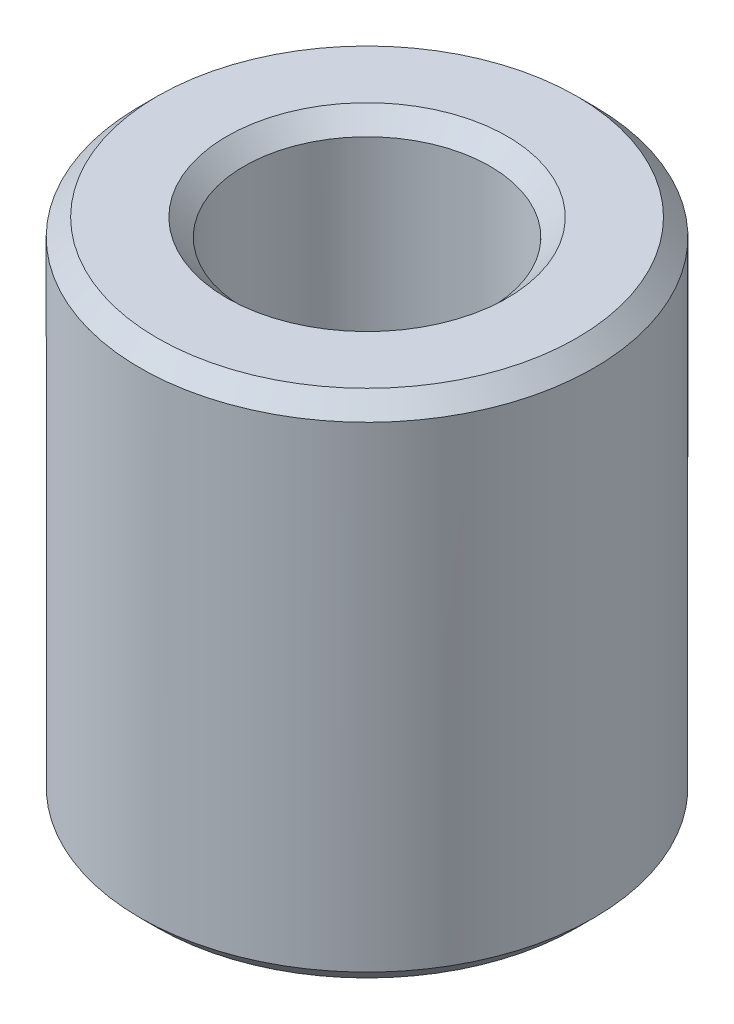
ISO-10303-21;
HEADER;
FILE_DESCRIPTION(('STEP AP214'),'2;1');
FILE_NAME('part.step','',(''),(''),'','','');
FILE_SCHEMA(('AUTOMOTIVE_DESIGN { 1 0 10303 214 1 1 1 1 }'));
ENDSEC;
DATA;
#1=APPLICATION_CONTEXT('core data for automotive mechanical design processes');
#2=APPLICATION_PROTOCOL_DEFINITION('international standard','automotive_design',2000,#1);
#3=PRODUCT_CONTEXT('',#1,'mechanical');
#4=PRODUCT('Part','Part','',(#3));
#5=PRODUCT_RELATED_PRODUCT_CATEGORY('part','',(#4));
#6=PRODUCT_DEFINITION_FORMATION('','',#4);
#7=PRODUCT_DEFINITION_CONTEXT('part definition',#1,'design');
#8=PRODUCT_DEFINITION('design','',#6,#7);
#9=PRODUCT_DEFINITION_SHAPE('','',#8);
#10=(LENGTH_UNIT() NAMED_UNIT(*) SI_UNIT(.MILLI.,.METRE.));
#11=(NAMED_UNIT(*) PLANE_ANGLE_UNIT() SI_UNIT($,.RADIAN.));
#12=(NAMED_UNIT(*) SI_UNIT($,.STERADIAN.) SOLID_ANGLE_UNIT());
#13=UNCERTAINTY_MEASURE_WITH_UNIT(LENGTH_MEASURE(1.E-05),#10,'distance_accuracy_value','');
#14=(GEOMETRIC_REPRESENTATION_CONTEXT(3) GLOBAL_UNCERTAINTY_ASSIGNED_CONTEXT((#13)) GLOBAL_UNIT_ASSIGNED_CONTEXT((#10,
#11,#12)) REPRESENTATION_CONTEXT('',''));
#15=CARTESIAN_POINT('',(0.,0.,0.));
#16=DIRECTION('',(0.,0.,1.));
#17=DIRECTION('',(1.,0.,0.));
#18=AXIS2_PLACEMENT_3D('',#15,#16,#17);
#19=CARTESIAN_POINT('',(0.,28.1367455428844,0.));
#20=DIRECTION('',(0.,-1.,0.));
#21=DIRECTION('',(0.,0.,-1.));
#22=AXIS2_PLACEMENT_3D('',#19,#20,#21);
#23=CYLINDRICAL_SURFACE('',#22,12.5);
#24=CARTESIAN_POINT('',(0.,0.951443880148138,0.));
#25=DIRECTION('',(0.,1.,0.));
#26=DIRECTION('',(0.,0.,1.));
#27=AXIS2_PLACEMENT_3D('',#24,#25,#26);
#28=CIRCLE('',#27,12.5);
#29=CARTESIAN_POINT('',(0.,0.951443880148135,-12.5));
#30=VERTEX_POINT('',#29);
#31=EDGE_CURVE('E10',#30,#30,#28,.T.);
#32=CARTESIAN_POINT('',(0.,27.1853016627363,0.));
#33=DIRECTION('',(0.,1.,0.));
#34=DIRECTION('',(0.,0.,1.));
#35=AXIS2_PLACEMENT_3D('',#32,#33,#34);
#36=CIRCLE('',#35,12.5);
#37=CARTESIAN_POINT('',(0.,27.1853016627363,-12.5));
#38=VERTEX_POINT('',#37);
#39=EDGE_CURVE('E50',#38,#38,#36,.F.);
#40=CARTESIAN_POINT('',(0.,0.951443880148135,-12.5));
#41=CARTESIAN_POINT('',(0.,1.22471323205009,-12.5));
#42=CARTESIAN_POINT('',(0.,1.49798258395206,-12.5));
#43=CARTESIAN_POINT('',(0.,2.04452128775598,-12.5));
#44=CARTESIAN_POINT('',(0.,2.31779063965794,-12.5));
#45=CARTESIAN_POINT('',(0.,2.86432934346186,-12.5));
#46=CARTESIAN_POINT('',(0.,3.13759869536382,-12.5));
#47=CARTESIAN_POINT('',(0.,3.68413739916774,-12.5));
#48=CARTESIAN_POINT('',(0.,3.9574067510697,-12.5));
#49=CARTESIAN_POINT('',(0.,4.50394545487362,-12.5));
#50=CARTESIAN_POINT('',(0.,4.77721480677558,-12.5));
#51=CARTESIAN_POINT('',(0.,5.3237535105795,-12.5));
#52=CARTESIAN_POINT('',(0.,5.59702286248146,-12.5));
#53=CARTESIAN_POINT('',(0.,6.14356156628538,-12.5));
#54=CARTESIAN_POINT('',(0.,6.41683091818734,-12.5));
#55=CARTESIAN_POINT('',(0.,6.96336962199126,-12.5));
#56=CARTESIAN_POINT('',(0.,7.23663897389322,-12.5));
#57=CARTESIAN_POINT('',(0.,7.78317767769714,-12.5));
#58=CARTESIAN_POINT('',(0.,8.0564470295991,-12.5));
#59=CARTESIAN_POINT('',(0.,8.60298573340302,-12.5));
#60=CARTESIAN_POINT('',(0.,8.87625508530499,-12.5));
#61=CARTESIAN_POINT('',(0.,9.42279378910891,-12.5));
#62=CARTESIAN_POINT('',(0.,9.69606314101087,-12.5));
#63=CARTESIAN_POINT('',(0.,10.2426018448148,-12.5));
#64=CARTESIAN_POINT('',(0.,10.5158711967167,-12.5));
#65=CARTESIAN_POINT('',(0.,11.0624099005207,-12.5));
#66=CARTESIAN_POINT('',(0.,11.3356792524226,-12.5));
#67=CARTESIAN_POINT('',(0.,11.8822179562265,-12.5));
#68=CARTESIAN_POINT('',(0.,12.1554873081285,-12.5));
#69=CARTESIAN_POINT('',(0.,12.7020260119324,-12.5));
#70=CARTESIAN_POINT('',(0.,12.9752953638344,-12.5));
#71=CARTESIAN_POINT('',(0.,13.5218340676383,-12.5));
#72=CARTESIAN_POINT('',(0.,13.7951034195403,-12.5));
#73=CARTESIAN_POINT('',(0.,14.3416421233442,-12.5));
#74=CARTESIAN_POINT('',(0.,14.6149114752462,-12.5));
#75=CARTESIAN_POINT('',(0.,15.1614501790501,-12.5));
#76=CARTESIAN_POINT('',(0.,15.434719530952,-12.5));
#77=CARTESIAN_POINT('',(0.,15.981258234756,-12.5));
#78=CARTESIAN_POINT('',(0.,16.2545275866579,-12.5));
#79=CARTESIAN_POINT('',(0.,16.8010662904618,-12.5));
#80=CARTESIAN_POINT('',(0.,17.0743356423638,-12.5));
#81=CARTESIAN_POINT('',(0.,17.6208743461677,-12.5));
#82=CARTESIAN_POINT('',(0.,17.8941436980697,-12.5));
#83=CARTESIAN_POINT('',(0.,18.4406824018736,-12.5));
#84=CARTESIAN_POINT('',(0.,18.7139517537756,-12.5));
#85=CARTESIAN_POINT('',(0.,19.2604904575795,-12.5));
#86=CARTESIAN_POINT('',(0.,19.5337598094814,-12.5));
#87=CARTESIAN_POINT('',(0.,20.0802985132854,-12.5));
#88=CARTESIAN_POINT('',(0.,20.3535678651873,-12.5));
#89=CARTESIAN_POINT('',(0.,20.9001065689912,-12.5));
#90=CARTESIAN_POINT('',(0.,21.1733759208932,-12.5));
#91=CARTESIAN_POINT('',(0.,21.7199146246971,-12.5));
#92=CARTESIAN_POINT('',(0.,21.9931839765991,-12.5));
#93=CARTESIAN_POINT('',(0.,22.539722680403,-12.5));
#94=CARTESIAN_POINT('',(0.,22.812992032305,-12.5));
#95=CARTESIAN_POINT('',(0.,23.3595307361089,-12.5));
#96=CARTESIAN_POINT('',(0.,23.6328000880108,-12.5));
#97=CARTESIAN_POINT('',(0.,24.1793387918148,-12.5));
#98=CARTESIAN_POINT('',(0.,24.4526081437167,-12.5));
#99=CARTESIAN_POINT('',(0.,24.9991468475206,-12.5));
#100=CARTESIAN_POINT('',(0.,25.2724161994226,-12.5));
#101=CARTESIAN_POINT('',(0.,25.8189549032265,-12.5));
#102=CARTESIAN_POINT('',(0.,26.0922242551285,-12.5));
#103=CARTESIAN_POINT('',(0.,26.6387629589324,-12.5));
#104=CARTESIAN_POINT('',(0.,26.9120323108344,-12.5));
#105=CARTESIAN_POINT('',(0.,27.1853016627363,-12.5));
#106=B_SPLINE_CURVE_WITH_KNOTS('',3,(#40,#41,#42,#43,#44,#45,#46,#47,#48,#49,#50,#51,#52,#53,
#54,#55,#56,#57,#58,#59,#60,#61,#62,#63,#64,#65,#66,#67,#68,#69,#70,#71,#72,#73,#74,#75,#76,#77,
#78,#79,#80,#81,#82,#83,#84,#85,#86,#87,#88,#89,#90,#91,#92,#93,#94,#95,#96,#97,#98,#99,#100,
#101,#102,#103,#104,#105),.UNSPECIFIED.,.F.,.F.,(4,2,2,2,2,2,2,2,2,2,2,2,2,2,2,2,2,2,2,2,2,2,2,
2,2,2,2,2,2,2,2,2,4),(0.,0.819808055705883,1.63961611141176,2.45942416711764,3.27923222282352,
4.09904027852941,4.91884833423529,5.73865638994117,6.55846444564705,7.37827250135293,
8.19808055705881,9.01788861276469,9.83769666847057,10.6575047241765,11.4773127798823,
12.2971208355882,13.1169288912941,13.936736947,14.7565450027059,15.5763530584117,
16.3961611141176,17.2159691698235,18.0357772255294,18.8555852812353,19.6753933369411,
20.495201392647,21.3150094483529,22.1348175040588,22.9546255597647,23.7744336154705,
24.5942416711764,25.4140497268823,26.2338577825882),.UNSPECIFIED.);
#107=EDGE_CURVE('BSEAM39',#30,#38,#106,.T.);
#108=ORIENTED_EDGE('',*,*,#31,.T.);
#109=ORIENTED_EDGE('',*,*,#39,.T.);
#110=ORIENTED_EDGE('',*,*,#107,.T.);
#111=ORIENTED_EDGE('',*,*,#107,.F.);
#112=EDGE_LOOP('',(#108,#110,#109,#111));
#113=FACE_BOUND('',#112,.T.);
#114=ADVANCED_FACE('F39',(#113),#23,.T.);
#115=CARTESIAN_POINT('',(0.,28.1367455428844,0.));
#116=DIRECTION('',(0.,1.,0.));
#117=DIRECTION('',(0.,0.,1.));
#118=AXIS2_PLACEMENT_3D('',#115,#116,#117);
#119=PLANE('',#118);
#120=CARTESIAN_POINT('',(0.,28.1367455428844,0.));
#121=DIRECTION('',(0.,1.,0.));
#122=DIRECTION('',(0.,0.,1.));
#123=AXIS2_PLACEMENT_3D('',#120,#121,#122);
#124=CIRCLE('',#123,7.72230259725046);
#125=CARTESIAN_POINT('',(0.,28.1367455428844,7.72230259725046));
#126=VERTEX_POINT('',#125);
#127=EDGE_CURVE('E58',#126,#126,#124,.F.);
#128=ORIENTED_EDGE('',*,*,#127,.T.);
#129=EDGE_LOOP('',(#128));
#130=FACE_BOUND('',#129,.T.);
#131=CARTESIAN_POINT('',(0.,28.1367455428844,0.));
#132=DIRECTION('',(0.,1.,0.));
#133=DIRECTION('',(0.,0.,1.));
#134=AXIS2_PLACEMENT_3D('',#131,#132,#133);
#135=CIRCLE('',#134,11.5485561198519);
#136=CARTESIAN_POINT('',(0.,28.1367455428844,11.5485561198519));
#137=VERTEX_POINT('',#136);
#138=EDGE_CURVE('E61',#137,#137,#135,.T.);
#139=ORIENTED_EDGE('',*,*,#138,.T.);
#140=EDGE_LOOP('',(#139));
#141=FACE_BOUND('',#140,.T.);
#142=ADVANCED_FACE('F88',(#130,#141),#119,.T.);
#143=CARTESIAN_POINT('',(0.,0.,0.));
#144=DIRECTION('',(0.,1.,0.));
#145=DIRECTION('',(0.,0.,1.));
#146=AXIS2_PLACEMENT_3D('',#143,#144,#145);
#147=PLANE('',#146);
#148=CARTESIAN_POINT('',(0.,0.,0.));
#149=DIRECTION('',(0.,1.,0.));
#150=DIRECTION('',(0.,0.,1.));
#151=AXIS2_PLACEMENT_3D('',#148,#149,#150);
#152=CIRCLE('',#151,7.72230259725041);
#153=CARTESIAN_POINT('',(0.,0.,-7.72230259725041));
#154=VERTEX_POINT('',#153);
#155=EDGE_CURVE('E51',#154,#154,#152,.T.);
#156=ORIENTED_EDGE('',*,*,#155,.T.);
#157=EDGE_LOOP('',(#156));
#158=FACE_BOUND('',#157,.T.);
#159=CARTESIAN_POINT('',(0.,0.,0.));
#160=DIRECTION('',(0.,1.,0.));
#161=DIRECTION('',(0.,0.,1.));
#162=AXIS2_PLACEMENT_3D('',#159,#160,#161);
#163=CIRCLE('',#162,11.5485561198519);
#164=CARTESIAN_POINT('',(0.,0.,11.5485561198519));
#165=VERTEX_POINT('',#164);
#166=EDGE_CURVE('E54',#165,#165,#163,.F.);
#167=ORIENTED_EDGE('',*,*,#166,.T.);
#168=EDGE_LOOP('',(#167));
#169=FACE_BOUND('',#168,.T.);
#170=ADVANCED_FACE('F83',(#158,#169),#147,.F.);
#171=CARTESIAN_POINT('',(0.,28.1367455428844,0.));
#172=DIRECTION('',(0.,-1.,0.));
#173=DIRECTION('',(0.,0.,-1.));
#174=AXIS2_PLACEMENT_3D('',#171,#172,#173);
#175=CYLINDRICAL_SURFACE('',#174,6.77085871710231);
#176=CARTESIAN_POINT('',(0.,27.1853016627363,0.));
#177=DIRECTION('',(0.,1.,0.));
#178=DIRECTION('',(0.,0.,1.));
#179=AXIS2_PLACEMENT_3D('',#176,#177,#178);
#180=CIRCLE('',#179,6.77085871710231);
#181=CARTESIAN_POINT('',(0.,27.1853016627363,-6.77085871710231));
#182=VERTEX_POINT('',#181);
#183=EDGE_CURVE('E67',#182,#182,#180,.T.);
#184=CARTESIAN_POINT('',(0.,0.951443880148103,0.));
#185=DIRECTION('',(0.,1.,0.));
#186=DIRECTION('',(0.,0.,1.));
#187=AXIS2_PLACEMENT_3D('',#184,#185,#186);
#188=CIRCLE('',#187,6.77085871710231);
#189=CARTESIAN_POINT('',(0.,0.9514438801481,-6.77085871710231));
#190=VERTEX_POINT('',#189);
#191=EDGE_CURVE('E69',#190,#190,#188,.F.);
#192=CARTESIAN_POINT('',(0.,27.1853016627363,-6.77085871710231));
#193=CARTESIAN_POINT('',(0.,26.9120323108343,-6.77085871710231));
#194=CARTESIAN_POINT('',(0.,26.6387629589324,-6.77085871710231));
#195=CARTESIAN_POINT('',(0.,26.0922242551285,-6.77085871710231));
#196=CARTESIAN_POINT('',(0.,25.8189549032265,-6.77085871710231));
#197=CARTESIAN_POINT('',(0.,25.2724161994226,-6.77085871710231));
#198=CARTESIAN_POINT('',(0.,24.9991468475206,-6.77085871710231));
#199=CARTESIAN_POINT('',(0.,24.4526081437167,-6.77085871710231));
#200=CARTESIAN_POINT('',(0.,24.1793387918147,-6.77085871710231));
#201=CARTESIAN_POINT('',(0.,23.6328000880108,-6.77085871710231));
#202=CARTESIAN_POINT('',(0.,23.3595307361088,-6.77085871710231));
#203=CARTESIAN_POINT('',(0.,22.8129920323049,-6.77085871710231));
#204=CARTESIAN_POINT('',(0.,22.539722680403,-6.77085871710231));
#205=CARTESIAN_POINT('',(0.,21.993183976599,-6.77085871710231));
#206=CARTESIAN_POINT('',(0.,21.7199146246971,-6.77085871710231));
#207=CARTESIAN_POINT('',(0.,21.1733759208932,-6.77085871710231));
#208=CARTESIAN_POINT('',(0.,20.9001065689912,-6.77085871710231));
#209=CARTESIAN_POINT('',(0.,20.3535678651873,-6.77085871710231));
#210=CARTESIAN_POINT('',(0.,20.0802985132853,-6.77085871710231));
#211=CARTESIAN_POINT('',(0.,19.5337598094814,-6.77085871710231));
#212=CARTESIAN_POINT('',(0.,19.2604904575794,-6.77085871710231));
#213=CARTESIAN_POINT('',(0.,18.7139517537755,-6.77085871710231));
#214=CARTESIAN_POINT('',(0.,18.4406824018736,-6.77085871710231));
#215=CARTESIAN_POINT('',(0.,17.8941436980696,-6.77085871710231));
#216=CARTESIAN_POINT('',(0.,17.6208743461677,-6.77085871710231));
#217=CARTESIAN_POINT('',(0.,17.0743356423638,-6.77085871710231));
#218=CARTESIAN_POINT('',(0.,16.8010662904618,-6.77085871710231));
#219=CARTESIAN_POINT('',(0.,16.2545275866579,-6.77085871710231));
#220=CARTESIAN_POINT('',(0.,15.9812582347559,-6.77085871710231));
#221=CARTESIAN_POINT('',(0.,15.434719530952,-6.77085871710231));
#222=CARTESIAN_POINT('',(0.,15.16145017905,-6.77085871710231));
#223=CARTESIAN_POINT('',(0.,14.6149114752461,-6.77085871710231));
#224=CARTESIAN_POINT('',(0.,14.3416421233442,-6.77085871710231));
#225=CARTESIAN_POINT('',(0.,13.7951034195402,-6.77085871710231));
#226=CARTESIAN_POINT('',(0.,13.5218340676383,-6.77085871710231));
#227=CARTESIAN_POINT('',(0.,12.9752953638344,-6.77085871710231));
#228=CARTESIAN_POINT('',(0.,12.7020260119324,-6.77085871710231));
#229=CARTESIAN_POINT('',(0.,12.1554873081285,-6.77085871710231));
#230=CARTESIAN_POINT('',(0.,11.8822179562265,-6.77085871710231));
#231=CARTESIAN_POINT('',(0.,11.3356792524226,-6.77085871710231));
#232=CARTESIAN_POINT('',(0.,11.0624099005206,-6.77085871710231));
#233=CARTESIAN_POINT('',(0.,10.5158711967167,-6.77085871710231));
#234=CARTESIAN_POINT('',(0.,10.2426018448148,-6.77085871710231));
#235=CARTESIAN_POINT('',(0.,9.69606314101083,-6.77085871710231));
#236=CARTESIAN_POINT('',(0.,9.42279378910887,-6.77085871710231));
#237=CARTESIAN_POINT('',(0.,8.87625508530495,-6.77085871710231));
#238=CARTESIAN_POINT('',(0.,8.60298573340299,-6.77085871710231));
#239=CARTESIAN_POINT('',(0.,8.05644702959907,-6.77085871710231));
#240=CARTESIAN_POINT('',(0.,7.78317767769711,-6.77085871710231));
#241=CARTESIAN_POINT('',(0.,7.23663897389319,-6.77085871710231));
#242=CARTESIAN_POINT('',(0.,6.96336962199123,-6.77085871710231));
#243=CARTESIAN_POINT('',(0.,6.41683091818731,-6.77085871710231));
#244=CARTESIAN_POINT('',(0.,6.14356156628535,-6.77085871710231));
#245=CARTESIAN_POINT('',(0.,5.59702286248143,-6.77085871710231));
#246=CARTESIAN_POINT('',(0.,5.32375351057947,-6.77085871710231));
#247=CARTESIAN_POINT('',(0.,4.77721480677554,-6.77085871710231));
#248=CARTESIAN_POINT('',(0.,4.50394545487358,-6.77085871710231));
#249=CARTESIAN_POINT('',(0.,3.95740675106966,-6.77085871710231));
#250=CARTESIAN_POINT('',(0.,3.68413739916771,-6.77085871710231));
#251=CARTESIAN_POINT('',(0.,3.13759869536379,-6.77085871710231));
#252=CARTESIAN_POINT('',(0.,2.86432934346183,-6.77085871710231));
#253=CARTESIAN_POINT('',(0.,2.3177906396579,-6.77085871710231));
#254=CARTESIAN_POINT('',(0.,2.04452128775594,-6.77085871710231));
#255=CARTESIAN_POINT('',(0.,1.49798258395202,-6.77085871710231));
#256=CARTESIAN_POINT('',(0.,1.22471323205006,-6.77085871710231));
#257=CARTESIAN_POINT('',(0.,0.9514438801481,-6.77085871710231));
#258=B_SPLINE_CURVE_WITH_KNOTS('',3,(#192,#193,#194,#195,#196,#197,#198,#199,#200,#201,#202,
#203,#204,#205,#206,#207,#208,#209,#210,#211,#212,#213,#214,#215,#216,#217,#218,#219,#220,#221,
#222,#223,#224,#225,#226,#227,#228,#229,#230,#231,#232,#233,#234,#235,#236,#237,#238,#239,#240,
#241,#242,#243,#244,#245,#246,#247,#248,#249,#250,#251,#252,#253,#254,#255,#256,#257),
.UNSPECIFIED.,.F.,.F.,(4,2,2,2,2,2,2,2,2,2,2,2,2,2,2,2,2,2,2,2,2,2,2,2,2,2,2,2,2,2,2,2,4),(0.,
0.819808055705883,1.63961611141176,2.45942416711764,3.27923222282353,4.09904027852941,
4.91884833423529,5.73865638994117,6.55846444564705,7.37827250135293,8.19808055705881,
9.01788861276469,9.83769666847057,10.6575047241765,11.4773127798823,12.2971208355882,
13.1169288912941,13.936736947,14.7565450027059,15.5763530584117,16.3961611141176,
17.2159691698235,18.0357772255294,18.8555852812353,19.6753933369411,20.495201392647,
21.3150094483529,22.1348175040588,22.9546255597647,23.7744336154705,24.5942416711764,
25.4140497268823,26.2338577825882),.UNSPECIFIED.);
#259=EDGE_CURVE('BSEAM71',#182,#190,#258,.T.);
#260=ORIENTED_EDGE('',*,*,#183,.T.);
#261=ORIENTED_EDGE('',*,*,#191,.T.);
#262=ORIENTED_EDGE('',*,*,#259,.T.);
#263=ORIENTED_EDGE('',*,*,#259,.F.);
#264=EDGE_LOOP('',(#260,#262,#261,#263));
#265=FACE_BOUND('',#264,.T.);
#266=ADVANCED_FACE('F71',(#265),#175,.F.);
#267=CARTESIAN_POINT('',(0.,27.1853016627363,0.));
#268=DIRECTION('',(0.,1.,0.));
#269=DIRECTION('',(0.,0.,1.));
#270=AXIS2_PLACEMENT_3D('',#267,#268,#269);
#271=CONICAL_SURFACE('',#270,6.77085871710231,0.785398163397452);
#272=ORIENTED_EDGE('',*,*,#127,.F.);
#273=EDGE_LOOP('',(#272));
#274=FACE_BOUND('',#273,.T.);
#275=ORIENTED_EDGE('',*,*,#183,.F.);
#276=EDGE_LOOP('',(#275));
#277=FACE_BOUND('',#276,.T.);
#278=ADVANCED_FACE('F77',(#274,#277),#271,.F.);
#279=CARTESIAN_POINT('',(0.,0.,0.));
#280=DIRECTION('',(0.,-1.,0.));
#281=DIRECTION('',(0.,0.,-1.));
#282=AXIS2_PLACEMENT_3D('',#279,#280,#281);
#283=CONICAL_SURFACE('',#282,7.72230259725041,0.785398163397445);
#284=CARTESIAN_POINT('',(0.,0.951443880148103,-6.77085871710231));
#285=CARTESIAN_POINT('',(0.,0.94153300639656,-6.78076959085386));
#286=CARTESIAN_POINT('',(0.,0.931622132645018,-6.7906804646054));
#287=CARTESIAN_POINT('',(0.,0.911800385141932,-6.81050221210849));
#288=CARTESIAN_POINT('',(0.,0.90188951139039,-6.82041308586003));
#289=CARTESIAN_POINT('',(0.,0.882067763887304,-6.84023483336311));
#290=CARTESIAN_POINT('',(0.,0.872156890135761,-6.85014570711466));
#291=CARTESIAN_POINT('',(0.,0.852335142632676,-6.86996745461774));
#292=CARTESIAN_POINT('',(0.,0.842424268881133,-6.87987832836928));
#293=CARTESIAN_POINT('',(0.,0.822602521378048,-6.89970007587237));
#294=CARTESIAN_POINT('',(0.,0.812691647626505,-6.90961094962391));
#295=CARTESIAN_POINT('',(0.,0.792869900123419,-6.929432697127));
#296=CARTESIAN_POINT('',(0.,0.782959026371877,-6.93934357087854));
#297=CARTESIAN_POINT('',(0.,0.763137278868791,-6.95916531838163));
#298=CARTESIAN_POINT('',(0.,0.753226405117248,-6.96907619213317));
#299=CARTESIAN_POINT('',(0.,0.733404657614163,-6.98889793963625));
#300=CARTESIAN_POINT('',(0.,0.72349378386262,-6.9988088133878));
#301=CARTESIAN_POINT('',(0.,0.703672036359535,-7.01863056089088));
#302=CARTESIAN_POINT('',(0.,0.693761162607992,-7.02854143464242));
#303=CARTESIAN_POINT('',(0.,0.673939415104906,-7.04836318214551));
#304=CARTESIAN_POINT('',(0.,0.664028541353364,-7.05827405589705));
#305=CARTESIAN_POINT('',(0.,0.644206793850278,-7.07809580340014));
#306=CARTESIAN_POINT('',(0.,0.634295920098736,-7.08800667715168));
#307=CARTESIAN_POINT('',(0.,0.61447417259565,-7.10782842465477));
#308=CARTESIAN_POINT('',(0.,0.604563298844107,-7.11773929840631));
#309=CARTESIAN_POINT('',(0.,0.584741551341022,-7.13756104590939));
#310=CARTESIAN_POINT('',(0.,0.574830677589479,-7.14747191966094));
#311=CARTESIAN_POINT('',(0.,0.555008930086394,-7.16729366716402));
#312=CARTESIAN_POINT('',(0.,0.545098056334851,-7.17720454091556));
#313=CARTESIAN_POINT('',(0.,0.525276308831765,-7.19702628841865));
#314=CARTESIAN_POINT('',(0.,0.515365435080223,-7.20693716217019));
#315=CARTESIAN_POINT('',(0.,0.495543687577137,-7.22675890967328));
#316=CARTESIAN_POINT('',(0.,0.485632813825594,-7.23666978342482));
#317=CARTESIAN_POINT('',(0.,0.465811066322509,-7.25649153092791));
#318=CARTESIAN_POINT('',(0.,0.455900192570966,-7.26640240467945));
#319=CARTESIAN_POINT('',(0.,0.436078445067881,-7.28622415218253));
#320=CARTESIAN_POINT('',(0.,0.426167571316338,-7.29613502593408));
#321=CARTESIAN_POINT('',(0.,0.406345823813253,-7.31595677343716));
#322=CARTESIAN_POINT('',(0.,0.39643495006171,-7.3258676471887));
#323=CARTESIAN_POINT('',(0.,0.376613202558624,-7.34568939469179));
#324=CARTESIAN_POINT('',(0.,0.366702328807081,-7.35560026844333));
#325=CARTESIAN_POINT('',(0.,0.346880581303996,-7.37542201594642));
#326=CARTESIAN_POINT('',(0.,0.336969707552453,-7.38533288969796));
#327=CARTESIAN_POINT('',(0.,0.317147960049368,-7.40515463720105));
#328=CARTESIAN_POINT('',(0.,0.307237086297825,-7.41506551095259));
#329=CARTESIAN_POINT('',(0.,0.287415338794739,-7.43488725845567));
#330=CARTESIAN_POINT('',(0.,0.277504465043197,-7.44479813220722));
#331=CARTESIAN_POINT('',(0.,0.257682717540111,-7.4646198797103));
#332=CARTESIAN_POINT('',(0.,0.247771843788569,-7.47453075346185));
#333=CARTESIAN_POINT('',(0.,0.227950096285483,-7.49435250096493));
#334=CARTESIAN_POINT('',(0.,0.21803922253394,-7.50426337471647));
#335=CARTESIAN_POINT('',(0.,0.198217475030855,-7.52408512221956));
#336=CARTESIAN_POINT('',(0.,0.188306601279312,-7.5339959959711));
#337=CARTESIAN_POINT('',(0.,0.168484853776227,-7.55381774347419));
#338=CARTESIAN_POINT('',(0.,0.158573980024684,-7.56372861722573));
#339=CARTESIAN_POINT('',(0.,0.138752232521598,-7.58355036472881));
#340=CARTESIAN_POINT('',(0.,0.128841358770056,-7.59346123848036));
#341=CARTESIAN_POINT('',(0.,0.10901961126697,-7.61328298598344));
#342=CARTESIAN_POINT('',(0.,0.0991087375154274,-7.62319385973499));
#343=CARTESIAN_POINT('',(0.,0.0792869900123419,-7.64301560723807));
#344=CARTESIAN_POINT('',(0.,0.0693761162607991,-7.65292648098961));
#345=CARTESIAN_POINT('',(0.,0.0495543687577137,-7.6727482284927));
#346=CARTESIAN_POINT('',(0.,0.039643495006171,-7.68265910224424));
#347=CARTESIAN_POINT('',(0.,0.0198217475030856,-7.70248084974733));
#348=CARTESIAN_POINT('',(0.,0.00991087375154294,-7.71239172349887));
#349=CARTESIAN_POINT('',(0.,0.,-7.72230259725041));
#350=B_SPLINE_CURVE_WITH_KNOTS('',3,(#284,#285,#286,#287,#288,#289,#290,#291,#292,#293,#294,
#295,#296,#297,#298,#299,#300,#301,#302,#303,#304,#305,#306,#307,#308,#309,#310,#311,#312,#313,
#314,#315,#316,#317,#318,#319,#320,#321,#322,#323,#324,#325,#326,#327,#328,#329,#330,#331,#332,
#333,#334,#335,#336,#337,#338,#339,#340,#341,#342,#343,#344,#345,#346,#347,#348,#349),
.UNSPECIFIED.,.F.,.F.,(4,2,2,2,2,2,2,2,2,2,2,2,2,2,2,2,2,2,2,2,2,2,2,2,2,2,2,2,2,2,2,2,4),(0.,
0.0420482762231975,0.0840965524463956,0.126144828669593,0.168193104892791,0.210241381115988,
0.252289657339186,0.294337933562384,0.336386209785581,0.378434486008779,0.420482762231977,
0.462531038455174,0.504579314678372,0.546627590901569,0.588675867124766,0.630724143347965,
0.672772419571162,0.71482069579436,0.756868972017558,0.798917248240755,0.840965524463953,
0.88301380068715,0.925062076910347,0.967110353133546,1.00915862935674,1.05120690557994,
1.09325518180314,1.13530345802634,1.17735173424953,1.21940001047273,1.26144828669593,
1.30349656291913,1.34554483914232),.UNSPECIFIED.);
#351=EDGE_CURVE('BSEAM73',#190,#154,#350,.T.);
#352=ORIENTED_EDGE('',*,*,#191,.F.);
#353=ORIENTED_EDGE('',*,*,#155,.F.);
#354=ORIENTED_EDGE('',*,*,#351,.T.);
#355=ORIENTED_EDGE('',*,*,#351,.F.);
#356=EDGE_LOOP('',(#352,#354,#353,#355));
#357=FACE_BOUND('',#356,.T.);
#358=ADVANCED_FACE('F73',(#357),#283,.F.);
#359=CARTESIAN_POINT('',(0.,0.951443880148138,0.));
#360=DIRECTION('',(0.,1.,0.));
#361=DIRECTION('',(0.,0.,1.));
#362=AXIS2_PLACEMENT_3D('',#359,#360,#361);
#363=CONICAL_SURFACE('',#362,12.5,0.785398163397453);
#364=ORIENTED_EDGE('',*,*,#166,.F.);
#365=EDGE_LOOP('',(#364));
#366=FACE_BOUND('',#365,.T.);
#367=ORIENTED_EDGE('',*,*,#31,.F.);
#368=EDGE_LOOP('',(#367));
#369=FACE_BOUND('',#368,.T.);
#370=ADVANCED_FACE('F76',(#366,#369),#363,.T.);
#371=CARTESIAN_POINT('',(0.,28.1367455428844,0.));
#372=DIRECTION('',(0.,-1.,0.));
#373=DIRECTION('',(0.,0.,-1.));
#374=AXIS2_PLACEMENT_3D('',#371,#372,#373);
#375=CONICAL_SURFACE('',#374,11.5485561198519,0.785398163397442);
#376=ORIENTED_EDGE('',*,*,#39,.F.);
#377=EDGE_LOOP('',(#376));
#378=FACE_BOUND('',#377,.T.);
#379=ORIENTED_EDGE('',*,*,#138,.F.);
#380=EDGE_LOOP('',(#379));
#381=FACE_BOUND('',#380,.T.);
#382=ADVANCED_FACE('F45',(#378,#381),#375,.T.);
#383=CLOSED_SHELL('',(#114,#142,#170,#266,#278,#358,#370,#382));
#384=MANIFOLD_SOLID_BREP('B2',#383);
#385=ADVANCED_BREP_SHAPE_REPRESENTATION('',(#18,#384),#14);
#386=SHAPE_DEFINITION_REPRESENTATION(#9,#385);
ENDSEC;
END-ISO-10303-21;
